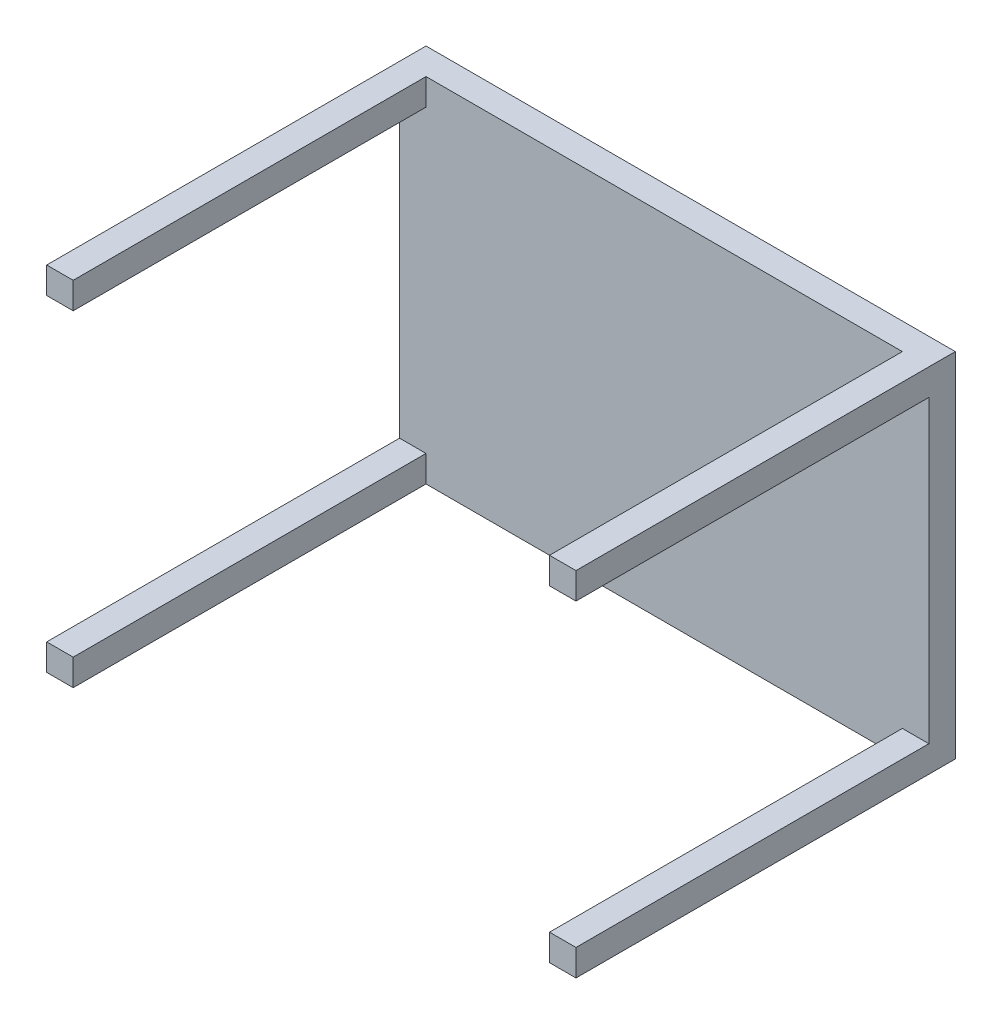
ISO-10303-21;
HEADER;
FILE_DESCRIPTION(('STEP AP214'),'2;1');
FILE_NAME('part.step','',(''),(''),'','','');
FILE_SCHEMA(('AUTOMOTIVE_DESIGN { 1 0 10303 214 1 1 1 1 }'));
ENDSEC;
DATA;
#1=APPLICATION_CONTEXT('core data for automotive mechanical design processes');
#2=APPLICATION_PROTOCOL_DEFINITION('international standard','automotive_design',2000,#1);
#3=PRODUCT_CONTEXT('',#1,'mechanical');
#4=PRODUCT('Part','Part','',(#3));
#5=PRODUCT_RELATED_PRODUCT_CATEGORY('part','',(#4));
#6=PRODUCT_DEFINITION_FORMATION('','',#4);
#7=PRODUCT_DEFINITION_CONTEXT('part definition',#1,'design');
#8=PRODUCT_DEFINITION('design','',#6,#7);
#9=PRODUCT_DEFINITION_SHAPE('','',#8);
#10=(LENGTH_UNIT() NAMED_UNIT(*) SI_UNIT(.MILLI.,.METRE.));
#11=(NAMED_UNIT(*) PLANE_ANGLE_UNIT() SI_UNIT($,.RADIAN.));
#12=(NAMED_UNIT(*) SI_UNIT($,.STERADIAN.) SOLID_ANGLE_UNIT());
#13=UNCERTAINTY_MEASURE_WITH_UNIT(LENGTH_MEASURE(1.E-05),#10,'distance_accuracy_value','');
#14=(GEOMETRIC_REPRESENTATION_CONTEXT(3) GLOBAL_UNCERTAINTY_ASSIGNED_CONTEXT((#13)) GLOBAL_UNIT_ASSIGNED_CONTEXT((#10,
#11,#12)) REPRESENTATION_CONTEXT('',''));
#15=CARTESIAN_POINT('',(0.,0.,0.));
#16=DIRECTION('',(0.,0.,1.));
#17=DIRECTION('',(1.,0.,0.));
#18=AXIS2_PLACEMENT_3D('',#15,#16,#17);
#19=CARTESIAN_POINT('',(0.,0.,30.));
#20=DIRECTION('',(0.,0.,1.));
#21=DIRECTION('',(1.,0.,0.));
#22=AXIS2_PLACEMENT_3D('',#19,#20,#21);
#23=PLANE('',#22);
#24=DIRECTION('',(-1.,0.,0.));
#25=VECTOR('',#24,1.);
#26=CARTESIAN_POINT('',(-299.999999999996,-170.,30.));
#27=LINE('',#26,#25);
#28=CARTESIAN_POINT('',(-269.999999999996,-170.,30.));
#29=VERTEX_POINT('',#28);
#30=CARTESIAN_POINT('',(-300.,-170.,30.));
#31=VERTEX_POINT('',#30);
#32=EDGE_CURVE('E50',#29,#31,#27,.T.);
#33=ORIENTED_EDGE('',*,*,#32,.F.);
#34=DIRECTION('',(0.,1.,0.));
#35=VECTOR('',#34,1.);
#36=CARTESIAN_POINT('',(-269.999999999996,-170.,30.));
#37=LINE('',#36,#35);
#38=CARTESIAN_POINT('',(-269.999999999996,-200.,30.));
#39=VERTEX_POINT('',#38);
#40=EDGE_CURVE('E169',#39,#29,#37,.T.);
#41=ORIENTED_EDGE('',*,*,#40,.F.);
#42=DIRECTION('',(1.,0.,0.));
#43=VECTOR('',#42,1.);
#44=CARTESIAN_POINT('',(300.,-200.,30.));
#45=LINE('',#44,#43);
#46=CARTESIAN_POINT('',(270.000000000004,-200.,30.));
#47=VERTEX_POINT('',#46);
#48=EDGE_CURVE('E274',#39,#47,#45,.T.);
#49=ORIENTED_EDGE('',*,*,#48,.T.);
#50=DIRECTION('',(0.,-1.,0.));
#51=VECTOR('',#50,1.);
#52=CARTESIAN_POINT('',(270.000000000004,-170.,30.));
#53=LINE('',#52,#51);
#54=CARTESIAN_POINT('',(270.000000000004,-170.,30.));
#55=VERTEX_POINT('',#54);
#56=EDGE_CURVE('E181',#55,#47,#53,.T.);
#57=ORIENTED_EDGE('',*,*,#56,.F.);
#58=DIRECTION('',(-1.,0.,0.));
#59=VECTOR('',#58,1.);
#60=CARTESIAN_POINT('',(270.000000000004,-170.,30.));
#61=LINE('',#60,#59);
#62=CARTESIAN_POINT('',(300.000000000004,-170.,30.));
#63=VERTEX_POINT('',#62);
#64=EDGE_CURVE('E186',#63,#55,#61,.T.);
#65=ORIENTED_EDGE('',*,*,#64,.F.);
#66=DIRECTION('',(0.,1.,0.));
#67=VECTOR('',#66,1.);
#68=CARTESIAN_POINT('',(300.,-200.,30.));
#69=LINE('',#68,#67);
#70=CARTESIAN_POINT('',(300.,170.,30.));
#71=VERTEX_POINT('',#70);
#72=EDGE_CURVE('E280',#63,#71,#69,.T.);
#73=ORIENTED_EDGE('',*,*,#72,.T.);
#74=DIRECTION('',(1.,0.,0.));
#75=VECTOR('',#74,1.);
#76=CARTESIAN_POINT('',(270.,170.,30.));
#77=LINE('',#76,#75);
#78=CARTESIAN_POINT('',(270.,170.,30.));
#79=VERTEX_POINT('',#78);
#80=EDGE_CURVE('E211',#79,#71,#77,.T.);
#81=ORIENTED_EDGE('',*,*,#80,.F.);
#82=DIRECTION('',(0.,-1.,0.));
#83=VECTOR('',#82,1.);
#84=CARTESIAN_POINT('',(270.,200.,30.));
#85=LINE('',#84,#83);
#86=CARTESIAN_POINT('',(270.,200.,30.));
#87=VERTEX_POINT('',#86);
#88=EDGE_CURVE('E206',#87,#79,#85,.T.);
#89=ORIENTED_EDGE('',*,*,#88,.F.);
#90=DIRECTION('',(-1.,0.,0.));
#91=VECTOR('',#90,1.);
#92=CARTESIAN_POINT('',(300.,200.,30.));
#93=LINE('',#92,#91);
#94=CARTESIAN_POINT('',(-270.,200.,30.));
#95=VERTEX_POINT('',#94);
#96=EDGE_CURVE('E36',#87,#95,#93,.T.);
#97=ORIENTED_EDGE('',*,*,#96,.T.);
#98=DIRECTION('',(0.,1.,0.));
#99=VECTOR('',#98,1.);
#100=CARTESIAN_POINT('',(-270.,200.,30.));
#101=LINE('',#100,#99);
#102=CARTESIAN_POINT('',(-270.,170.,30.));
#103=VERTEX_POINT('',#102);
#104=EDGE_CURVE('E236',#103,#95,#101,.T.);
#105=ORIENTED_EDGE('',*,*,#104,.F.);
#106=DIRECTION('',(1.,0.,0.));
#107=VECTOR('',#106,1.);
#108=CARTESIAN_POINT('',(-300.,170.,30.));
#109=LINE('',#108,#107);
#110=CARTESIAN_POINT('',(-300.,170.,30.));
#111=VERTEX_POINT('',#110);
#112=EDGE_CURVE('E231',#111,#103,#109,.T.);
#113=ORIENTED_EDGE('',*,*,#112,.F.);
#114=DIRECTION('',(0.,-1.,0.));
#115=VECTOR('',#114,1.);
#116=CARTESIAN_POINT('',(-300.,-200.,30.));
#117=LINE('',#116,#115);
#118=EDGE_CURVE('E55',#111,#31,#117,.T.);
#119=ORIENTED_EDGE('',*,*,#118,.T.);
#120=EDGE_LOOP('',(#33,#41,#49,#57,#65,#73,#81,#89,#97,#105,#113,#119));
#121=FACE_BOUND('',#120,.T.);
#122=ADVANCED_FACE('F32',(#121),#23,.T.);
#123=CARTESIAN_POINT('',(-300.,-200.,30.));
#124=DIRECTION('',(1.,0.,0.));
#125=DIRECTION('',(0.,0.,-1.));
#126=AXIS2_PLACEMENT_3D('',#123,#124,#125);
#127=PLANE('',#126);
#128=DIRECTION('',(0.,-1.,0.));
#129=VECTOR('',#128,1.);
#130=CARTESIAN_POINT('',(-300.,-200.,0.));
#131=LINE('',#130,#129);
#132=CARTESIAN_POINT('',(-300.,200.,0.));
#133=VERTEX_POINT('',#132);
#134=CARTESIAN_POINT('',(-300.,-200.,0.));
#135=VERTEX_POINT('',#134);
#136=EDGE_CURVE('E153',#133,#135,#131,.T.);
#137=ORIENTED_EDGE('',*,*,#136,.T.);
#138=DIRECTION('',(0.,0.,-1.));
#139=VECTOR('',#138,1.);
#140=CARTESIAN_POINT('',(-300.,-200.,30.));
#141=LINE('',#140,#139);
#142=CARTESIAN_POINT('',(-299.999999999996,-200.,430.));
#143=VERTEX_POINT('',#142);
#144=EDGE_CURVE('E11',#143,#135,#141,.T.);
#145=ORIENTED_EDGE('',*,*,#144,.F.);
#146=DIRECTION('',(0.,-1.,0.));
#147=VECTOR('',#146,1.);
#148=CARTESIAN_POINT('',(-299.999999999996,-170.,430.));
#149=LINE('',#148,#147);
#150=CARTESIAN_POINT('',(-299.999999999996,-170.,430.));
#151=VERTEX_POINT('',#150);
#152=EDGE_CURVE('E150',#151,#143,#149,.T.);
#153=ORIENTED_EDGE('',*,*,#152,.F.);
#154=DIRECTION('',(0.,0.,-1.));
#155=VECTOR('',#154,1.);
#156=CARTESIAN_POINT('',(-299.999999999996,-170.,430.));
#157=LINE('',#156,#155);
#158=EDGE_CURVE('E174',#151,#31,#157,.T.);
#159=ORIENTED_EDGE('',*,*,#158,.T.);
#160=ORIENTED_EDGE('',*,*,#118,.F.);
#161=DIRECTION('',(0.,0.,-1.));
#162=VECTOR('',#161,1.);
#163=CARTESIAN_POINT('',(-300.,170.,430.));
#164=LINE('',#163,#162);
#165=CARTESIAN_POINT('',(-300.,170.,430.));
#166=VERTEX_POINT('',#165);
#167=EDGE_CURVE('E260',#166,#111,#164,.T.);
#168=ORIENTED_EDGE('',*,*,#167,.F.);
#169=DIRECTION('',(0.,-1.,0.));
#170=VECTOR('',#169,1.);
#171=CARTESIAN_POINT('',(-300.,200.,430.));
#172=LINE('',#171,#170);
#173=CARTESIAN_POINT('',(-300.,200.,430.));
#174=VERTEX_POINT('',#173);
#175=EDGE_CURVE('E232',#174,#166,#172,.T.);
#176=ORIENTED_EDGE('',*,*,#175,.F.);
#177=DIRECTION('',(0.,0.,-1.));
#178=VECTOR('',#177,1.);
#179=CARTESIAN_POINT('',(-300.,200.,30.));
#180=LINE('',#179,#178);
#181=EDGE_CURVE('E287',#174,#133,#180,.T.);
#182=ORIENTED_EDGE('',*,*,#181,.T.);
#183=EDGE_LOOP('',(#137,#145,#153,#159,#160,#168,#176,#182));
#184=FACE_BOUND('',#183,.T.);
#185=ADVANCED_FACE('F34',(#184),#127,.F.);
#186=CARTESIAN_POINT('',(300.,-200.,30.));
#187=DIRECTION('',(0.,1.,0.));
#188=DIRECTION('',(-1.,0.,0.));
#189=AXIS2_PLACEMENT_3D('',#186,#187,#188);
#190=PLANE('',#189);
#191=DIRECTION('',(1.,0.,0.));
#192=VECTOR('',#191,1.);
#193=CARTESIAN_POINT('',(300.,-200.,0.));
#194=LINE('',#193,#192);
#195=CARTESIAN_POINT('',(300.,-200.,0.));
#196=VERTEX_POINT('',#195);
#197=EDGE_CURVE('E268',#135,#196,#194,.T.);
#198=ORIENTED_EDGE('',*,*,#197,.T.);
#199=DIRECTION('',(0.,0.,-1.));
#200=VECTOR('',#199,1.);
#201=CARTESIAN_POINT('',(300.,-200.,30.));
#202=LINE('',#201,#200);
#203=CARTESIAN_POINT('',(300.000000000004,-200.,430.));
#204=VERTEX_POINT('',#203);
#205=EDGE_CURVE('E42',#204,#196,#202,.T.);
#206=ORIENTED_EDGE('',*,*,#205,.F.);
#207=DIRECTION('',(1.,0.,0.));
#208=VECTOR('',#207,1.);
#209=CARTESIAN_POINT('',(270.000000000004,-200.,430.));
#210=LINE('',#209,#208);
#211=CARTESIAN_POINT('',(270.000000000004,-200.,430.));
#212=VERTEX_POINT('',#211);
#213=EDGE_CURVE('E185',#212,#204,#210,.T.);
#214=ORIENTED_EDGE('',*,*,#213,.F.);
#215=DIRECTION('',(0.,0.,-1.));
#216=VECTOR('',#215,1.);
#217=CARTESIAN_POINT('',(270.000000000004,-200.,430.));
#218=LINE('',#217,#216);
#219=EDGE_CURVE('E203',#212,#47,#218,.T.);
#220=ORIENTED_EDGE('',*,*,#219,.T.);
#221=ORIENTED_EDGE('',*,*,#48,.F.);
#222=DIRECTION('',(0.,0.,-1.));
#223=VECTOR('',#222,1.);
#224=CARTESIAN_POINT('',(-269.999999999996,-200.,430.));
#225=LINE('',#224,#223);
#226=CARTESIAN_POINT('',(-269.999999999996,-200.,430.));
#227=VERTEX_POINT('',#226);
#228=EDGE_CURVE('E159',#227,#39,#225,.T.);
#229=ORIENTED_EDGE('',*,*,#228,.F.);
#230=DIRECTION('',(1.,0.,0.));
#231=VECTOR('',#230,1.);
#232=CARTESIAN_POINT('',(-299.999999999996,-200.,430.));
#233=LINE('',#232,#231);
#234=EDGE_CURVE('E156',#143,#227,#233,.T.);
#235=ORIENTED_EDGE('',*,*,#234,.F.);
#236=ORIENTED_EDGE('',*,*,#144,.T.);
#237=EDGE_LOOP('',(#198,#206,#214,#220,#221,#229,#235,#236));
#238=FACE_BOUND('',#237,.T.);
#239=ADVANCED_FACE('F157',(#238),#190,.F.);
#240=CARTESIAN_POINT('',(300.,-200.,30.));
#241=DIRECTION('',(-1.,0.,0.));
#242=DIRECTION('',(0.,0.,1.));
#243=AXIS2_PLACEMENT_3D('',#240,#241,#242);
#244=PLANE('',#243);
#245=DIRECTION('',(0.,1.,0.));
#246=VECTOR('',#245,1.);
#247=CARTESIAN_POINT('',(300.,-200.,0.));
#248=LINE('',#247,#246);
#249=CARTESIAN_POINT('',(300.,200.,0.));
#250=VERTEX_POINT('',#249);
#251=EDGE_CURVE('E284',#196,#250,#248,.T.);
#252=ORIENTED_EDGE('',*,*,#251,.T.);
#253=DIRECTION('',(0.,0.,-1.));
#254=VECTOR('',#253,1.);
#255=CARTESIAN_POINT('',(300.,200.,30.));
#256=LINE('',#255,#254);
#257=CARTESIAN_POINT('',(300.,200.,430.));
#258=VERTEX_POINT('',#257);
#259=EDGE_CURVE('E289',#258,#250,#256,.T.);
#260=ORIENTED_EDGE('',*,*,#259,.F.);
#261=DIRECTION('',(0.,1.,0.));
#262=VECTOR('',#261,1.);
#263=CARTESIAN_POINT('',(300.,200.,430.));
#264=LINE('',#263,#262);
#265=CARTESIAN_POINT('',(300.,170.,430.));
#266=VERTEX_POINT('',#265);
#267=EDGE_CURVE('E213',#266,#258,#264,.T.);
#268=ORIENTED_EDGE('',*,*,#267,.F.);
#269=DIRECTION('',(0.,0.,-1.));
#270=VECTOR('',#269,1.);
#271=CARTESIAN_POINT('',(300.,170.,430.));
#272=LINE('',#271,#270);
#273=EDGE_CURVE('E225',#266,#71,#272,.T.);
#274=ORIENTED_EDGE('',*,*,#273,.T.);
#275=ORIENTED_EDGE('',*,*,#72,.F.);
#276=DIRECTION('',(0.,0.,-1.));
#277=VECTOR('',#276,1.);
#278=CARTESIAN_POINT('',(300.000000000004,-170.,430.));
#279=LINE('',#278,#277);
#280=CARTESIAN_POINT('',(300.000000000004,-170.,430.));
#281=VERTEX_POINT('',#280);
#282=EDGE_CURVE('E200',#281,#63,#279,.T.);
#283=ORIENTED_EDGE('',*,*,#282,.F.);
#284=DIRECTION('',(0.,1.,0.));
#285=VECTOR('',#284,1.);
#286=CARTESIAN_POINT('',(300.000000000004,-170.,430.));
#287=LINE('',#286,#285);
#288=EDGE_CURVE('E189',#204,#281,#287,.T.);
#289=ORIENTED_EDGE('',*,*,#288,.F.);
#290=ORIENTED_EDGE('',*,*,#205,.T.);
#291=EDGE_LOOP('',(#252,#260,#268,#274,#275,#283,#289,#290));
#292=FACE_BOUND('',#291,.T.);
#293=ADVANCED_FACE('F295',(#292),#244,.F.);
#294=CARTESIAN_POINT('',(300.,200.,30.));
#295=DIRECTION('',(0.,-1.,0.));
#296=DIRECTION('',(1.,0.,0.));
#297=AXIS2_PLACEMENT_3D('',#294,#295,#296);
#298=PLANE('',#297);
#299=DIRECTION('',(-1.,0.,0.));
#300=VECTOR('',#299,1.);
#301=CARTESIAN_POINT('',(300.,200.,0.));
#302=LINE('',#301,#300);
#303=EDGE_CURVE('E275',#250,#133,#302,.T.);
#304=ORIENTED_EDGE('',*,*,#303,.T.);
#305=ORIENTED_EDGE('',*,*,#181,.F.);
#306=DIRECTION('',(-1.,0.,0.));
#307=VECTOR('',#306,1.);
#308=CARTESIAN_POINT('',(-300.,200.,430.));
#309=LINE('',#308,#307);
#310=CARTESIAN_POINT('',(-270.,200.,430.));
#311=VERTEX_POINT('',#310);
#312=EDGE_CURVE('E240',#311,#174,#309,.T.);
#313=ORIENTED_EDGE('',*,*,#312,.F.);
#314=DIRECTION('',(0.,0.,-1.));
#315=VECTOR('',#314,1.);
#316=CARTESIAN_POINT('',(-270.,200.,430.));
#317=LINE('',#316,#315);
#318=EDGE_CURVE('E243',#311,#95,#317,.T.);
#319=ORIENTED_EDGE('',*,*,#318,.T.);
#320=ORIENTED_EDGE('',*,*,#96,.F.);
#321=DIRECTION('',(0.,0.,-1.));
#322=VECTOR('',#321,1.);
#323=CARTESIAN_POINT('',(270.,200.,430.));
#324=LINE('',#323,#322);
#325=CARTESIAN_POINT('',(270.,200.,430.));
#326=VERTEX_POINT('',#325);
#327=EDGE_CURVE('E218',#326,#87,#324,.T.);
#328=ORIENTED_EDGE('',*,*,#327,.F.);
#329=DIRECTION('',(-1.,0.,0.));
#330=VECTOR('',#329,1.);
#331=CARTESIAN_POINT('',(270.,200.,430.));
#332=LINE('',#331,#330);
#333=EDGE_CURVE('E216',#258,#326,#332,.T.);
#334=ORIENTED_EDGE('',*,*,#333,.F.);
#335=ORIENTED_EDGE('',*,*,#259,.T.);
#336=EDGE_LOOP('',(#304,#305,#313,#319,#320,#328,#334,#335));
#337=FACE_BOUND('',#336,.T.);
#338=ADVANCED_FACE('F300',(#337),#298,.F.);
#339=CARTESIAN_POINT('',(0.,0.,0.));
#340=DIRECTION('',(0.,0.,1.));
#341=DIRECTION('',(1.,0.,0.));
#342=AXIS2_PLACEMENT_3D('',#339,#340,#341);
#343=PLANE('',#342);
#344=ORIENTED_EDGE('',*,*,#136,.F.);
#345=ORIENTED_EDGE('',*,*,#303,.F.);
#346=ORIENTED_EDGE('',*,*,#251,.F.);
#347=ORIENTED_EDGE('',*,*,#197,.F.);
#348=EDGE_LOOP('',(#344,#345,#346,#347));
#349=FACE_BOUND('',#348,.T.);
#350=ADVANCED_FACE('F299',(#349),#343,.F.);
#351=CARTESIAN_POINT('',(-300.,170.,430.));
#352=DIRECTION('',(0.,1.,0.));
#353=DIRECTION('',(0.,0.,1.));
#354=AXIS2_PLACEMENT_3D('',#351,#352,#353);
#355=PLANE('',#354);
#356=ORIENTED_EDGE('',*,*,#112,.T.);
#357=DIRECTION('',(0.,0.,-1.));
#358=VECTOR('',#357,1.);
#359=CARTESIAN_POINT('',(-270.,170.,430.));
#360=LINE('',#359,#358);
#361=CARTESIAN_POINT('',(-270.,170.,430.));
#362=VERTEX_POINT('',#361);
#363=EDGE_CURVE('E246',#362,#103,#360,.T.);
#364=ORIENTED_EDGE('',*,*,#363,.F.);
#365=DIRECTION('',(1.,0.,0.));
#366=VECTOR('',#365,1.);
#367=CARTESIAN_POINT('',(-300.,170.,430.));
#368=LINE('',#367,#366);
#369=EDGE_CURVE('E235',#166,#362,#368,.T.);
#370=ORIENTED_EDGE('',*,*,#369,.F.);
#371=ORIENTED_EDGE('',*,*,#167,.T.);
#372=EDGE_LOOP('',(#356,#364,#370,#371));
#373=FACE_BOUND('',#372,.T.);
#374=ADVANCED_FACE('F307',(#373),#355,.F.);
#375=CARTESIAN_POINT('',(-270.,200.,430.));
#376=DIRECTION('',(-1.,0.,0.));
#377=DIRECTION('',(0.,0.,1.));
#378=AXIS2_PLACEMENT_3D('',#375,#376,#377);
#379=PLANE('',#378);
#380=ORIENTED_EDGE('',*,*,#104,.T.);
#381=ORIENTED_EDGE('',*,*,#318,.F.);
#382=DIRECTION('',(0.,1.,0.));
#383=VECTOR('',#382,1.);
#384=CARTESIAN_POINT('',(-270.,200.,430.));
#385=LINE('',#384,#383);
#386=EDGE_CURVE('E238',#362,#311,#385,.T.);
#387=ORIENTED_EDGE('',*,*,#386,.F.);
#388=ORIENTED_EDGE('',*,*,#363,.T.);
#389=EDGE_LOOP('',(#380,#381,#387,#388));
#390=FACE_BOUND('',#389,.T.);
#391=ADVANCED_FACE('F305',(#390),#379,.F.);
#392=CARTESIAN_POINT('',(0.,0.,430.));
#393=DIRECTION('',(0.,0.,1.));
#394=DIRECTION('',(1.,0.,0.));
#395=AXIS2_PLACEMENT_3D('',#392,#393,#394);
#396=PLANE('',#395);
#397=ORIENTED_EDGE('',*,*,#175,.T.);
#398=ORIENTED_EDGE('',*,*,#369,.T.);
#399=ORIENTED_EDGE('',*,*,#386,.T.);
#400=ORIENTED_EDGE('',*,*,#312,.T.);
#401=EDGE_LOOP('',(#397,#398,#399,#400));
#402=FACE_BOUND('',#401,.T.);
#403=ADVANCED_FACE('F304',(#402),#396,.T.);
#404=CARTESIAN_POINT('',(270.,200.,430.));
#405=DIRECTION('',(1.,0.,0.));
#406=DIRECTION('',(0.,0.,-1.));
#407=AXIS2_PLACEMENT_3D('',#404,#405,#406);
#408=PLANE('',#407);
#409=ORIENTED_EDGE('',*,*,#88,.T.);
#410=DIRECTION('',(0.,0.,-1.));
#411=VECTOR('',#410,1.);
#412=CARTESIAN_POINT('',(270.,170.,430.));
#413=LINE('',#412,#411);
#414=CARTESIAN_POINT('',(270.,170.,430.));
#415=VERTEX_POINT('',#414);
#416=EDGE_CURVE('E228',#415,#79,#413,.T.);
#417=ORIENTED_EDGE('',*,*,#416,.F.);
#418=DIRECTION('',(0.,-1.,0.));
#419=VECTOR('',#418,1.);
#420=CARTESIAN_POINT('',(270.,200.,430.));
#421=LINE('',#420,#419);
#422=EDGE_CURVE('E207',#326,#415,#421,.T.);
#423=ORIENTED_EDGE('',*,*,#422,.F.);
#424=ORIENTED_EDGE('',*,*,#327,.T.);
#425=EDGE_LOOP('',(#409,#417,#423,#424));
#426=FACE_BOUND('',#425,.T.);
#427=ADVANCED_FACE('F397',(#426),#408,.F.);
#428=CARTESIAN_POINT('',(270.,170.,430.));
#429=DIRECTION('',(0.,1.,0.));
#430=DIRECTION('',(0.,0.,1.));
#431=AXIS2_PLACEMENT_3D('',#428,#429,#430);
#432=PLANE('',#431);
#433=ORIENTED_EDGE('',*,*,#80,.T.);
#434=ORIENTED_EDGE('',*,*,#273,.F.);
#435=DIRECTION('',(1.,0.,0.));
#436=VECTOR('',#435,1.);
#437=CARTESIAN_POINT('',(270.,170.,430.));
#438=LINE('',#437,#436);
#439=EDGE_CURVE('E210',#415,#266,#438,.T.);
#440=ORIENTED_EDGE('',*,*,#439,.F.);
#441=ORIENTED_EDGE('',*,*,#416,.T.);
#442=EDGE_LOOP('',(#433,#434,#440,#441));
#443=FACE_BOUND('',#442,.T.);
#444=ADVANCED_FACE('F405',(#443),#432,.F.);
#445=CARTESIAN_POINT('',(0.,0.,430.));
#446=DIRECTION('',(0.,0.,1.));
#447=DIRECTION('',(1.,0.,0.));
#448=AXIS2_PLACEMENT_3D('',#445,#446,#447);
#449=PLANE('',#448);
#450=ORIENTED_EDGE('',*,*,#422,.T.);
#451=ORIENTED_EDGE('',*,*,#439,.T.);
#452=ORIENTED_EDGE('',*,*,#267,.T.);
#453=ORIENTED_EDGE('',*,*,#333,.T.);
#454=EDGE_LOOP('',(#450,#451,#452,#453));
#455=FACE_BOUND('',#454,.T.);
#456=ADVANCED_FACE('F414',(#455),#449,.T.);
#457=CARTESIAN_POINT('',(270.000000000004,-170.,430.));
#458=DIRECTION('',(1.,0.,0.));
#459=DIRECTION('',(0.,0.,-1.));
#460=AXIS2_PLACEMENT_3D('',#457,#458,#459);
#461=PLANE('',#460);
#462=ORIENTED_EDGE('',*,*,#56,.T.);
#463=ORIENTED_EDGE('',*,*,#219,.F.);
#464=DIRECTION('',(0.,-1.,0.));
#465=VECTOR('',#464,1.);
#466=CARTESIAN_POINT('',(270.000000000004,-170.,430.));
#467=LINE('',#466,#465);
#468=CARTESIAN_POINT('',(270.000000000004,-170.,430.));
#469=VERTEX_POINT('',#468);
#470=EDGE_CURVE('E182',#469,#212,#467,.T.);
#471=ORIENTED_EDGE('',*,*,#470,.F.);
#472=DIRECTION('',(0.,0.,-1.));
#473=VECTOR('',#472,1.);
#474=CARTESIAN_POINT('',(270.000000000004,-170.,430.));
#475=LINE('',#474,#473);
#476=EDGE_CURVE('E193',#469,#55,#475,.T.);
#477=ORIENTED_EDGE('',*,*,#476,.T.);
#478=EDGE_LOOP('',(#462,#463,#471,#477));
#479=FACE_BOUND('',#478,.T.);
#480=ADVANCED_FACE('F423',(#479),#461,.F.);
#481=CARTESIAN_POINT('',(270.000000000004,-170.,430.));
#482=DIRECTION('',(0.,-1.,0.));
#483=DIRECTION('',(0.,0.,-1.));
#484=AXIS2_PLACEMENT_3D('',#481,#482,#483);
#485=PLANE('',#484);
#486=ORIENTED_EDGE('',*,*,#64,.T.);
#487=ORIENTED_EDGE('',*,*,#476,.F.);
#488=DIRECTION('',(-1.,0.,0.));
#489=VECTOR('',#488,1.);
#490=CARTESIAN_POINT('',(270.000000000004,-170.,430.));
#491=LINE('',#490,#489);
#492=EDGE_CURVE('E191',#281,#469,#491,.T.);
#493=ORIENTED_EDGE('',*,*,#492,.F.);
#494=ORIENTED_EDGE('',*,*,#282,.T.);
#495=EDGE_LOOP('',(#486,#487,#493,#494));
#496=FACE_BOUND('',#495,.T.);
#497=ADVANCED_FACE('F432',(#496),#485,.F.);
#498=CARTESIAN_POINT('',(0.,0.,430.));
#499=DIRECTION('',(0.,0.,1.));
#500=DIRECTION('',(1.,0.,0.));
#501=AXIS2_PLACEMENT_3D('',#498,#499,#500);
#502=PLANE('',#501);
#503=ORIENTED_EDGE('',*,*,#470,.T.);
#504=ORIENTED_EDGE('',*,*,#213,.T.);
#505=ORIENTED_EDGE('',*,*,#288,.T.);
#506=ORIENTED_EDGE('',*,*,#492,.T.);
#507=EDGE_LOOP('',(#503,#504,#505,#506));
#508=FACE_BOUND('',#507,.T.);
#509=ADVANCED_FACE('F441',(#508),#502,.T.);
#510=CARTESIAN_POINT('',(-269.999999999996,-170.,430.));
#511=DIRECTION('',(-1.,0.,0.));
#512=DIRECTION('',(0.,0.,1.));
#513=AXIS2_PLACEMENT_3D('',#510,#511,#512);
#514=PLANE('',#513);
#515=ORIENTED_EDGE('',*,*,#40,.T.);
#516=DIRECTION('',(0.,0.,-1.));
#517=VECTOR('',#516,1.);
#518=CARTESIAN_POINT('',(-269.999999999996,-170.,430.));
#519=LINE('',#518,#517);
#520=CARTESIAN_POINT('',(-269.999999999996,-170.,430.));
#521=VERTEX_POINT('',#520);
#522=EDGE_CURVE('E177',#521,#29,#519,.T.);
#523=ORIENTED_EDGE('',*,*,#522,.F.);
#524=DIRECTION('',(0.,1.,0.));
#525=VECTOR('',#524,1.);
#526=CARTESIAN_POINT('',(-269.999999999996,-170.,430.));
#527=LINE('',#526,#525);
#528=EDGE_CURVE('E162',#227,#521,#527,.T.);
#529=ORIENTED_EDGE('',*,*,#528,.F.);
#530=ORIENTED_EDGE('',*,*,#228,.T.);
#531=EDGE_LOOP('',(#515,#523,#529,#530));
#532=FACE_BOUND('',#531,.T.);
#533=ADVANCED_FACE('F450',(#532),#514,.F.);
#534=CARTESIAN_POINT('',(-299.999999999996,-170.,430.));
#535=DIRECTION('',(0.,-1.,0.));
#536=DIRECTION('',(0.,0.,-1.));
#537=AXIS2_PLACEMENT_3D('',#534,#535,#536);
#538=PLANE('',#537);
#539=ORIENTED_EDGE('',*,*,#32,.T.);
#540=ORIENTED_EDGE('',*,*,#158,.F.);
#541=DIRECTION('',(-1.,0.,0.));
#542=VECTOR('',#541,1.);
#543=CARTESIAN_POINT('',(-299.999999999996,-170.,430.));
#544=LINE('',#543,#542);
#545=EDGE_CURVE('E166',#521,#151,#544,.T.);
#546=ORIENTED_EDGE('',*,*,#545,.F.);
#547=ORIENTED_EDGE('',*,*,#522,.T.);
#548=EDGE_LOOP('',(#539,#540,#546,#547));
#549=FACE_BOUND('',#548,.T.);
#550=ADVANCED_FACE('F459',(#549),#538,.F.);
#551=CARTESIAN_POINT('',(0.,0.,430.));
#552=DIRECTION('',(0.,0.,1.));
#553=DIRECTION('',(1.,0.,0.));
#554=AXIS2_PLACEMENT_3D('',#551,#552,#553);
#555=PLANE('',#554);
#556=ORIENTED_EDGE('',*,*,#152,.T.);
#557=ORIENTED_EDGE('',*,*,#234,.T.);
#558=ORIENTED_EDGE('',*,*,#528,.T.);
#559=ORIENTED_EDGE('',*,*,#545,.T.);
#560=EDGE_LOOP('',(#556,#557,#558,#559));
#561=FACE_BOUND('',#560,.T.);
#562=ADVANCED_FACE('F164',(#561),#555,.T.);
#563=CLOSED_SHELL('',(#122,#185,#239,#293,#338,#350,#374,#391,#403,#427,#444,#456,#480,#497,
#509,#533,#550,#562));
#564=MANIFOLD_SOLID_BREP('B2',#563);
#565=ADVANCED_BREP_SHAPE_REPRESENTATION('',(#18,#564),#14);
#566=SHAPE_DEFINITION_REPRESENTATION(#9,#565);
ENDSEC;
END-ISO-10303-21;
